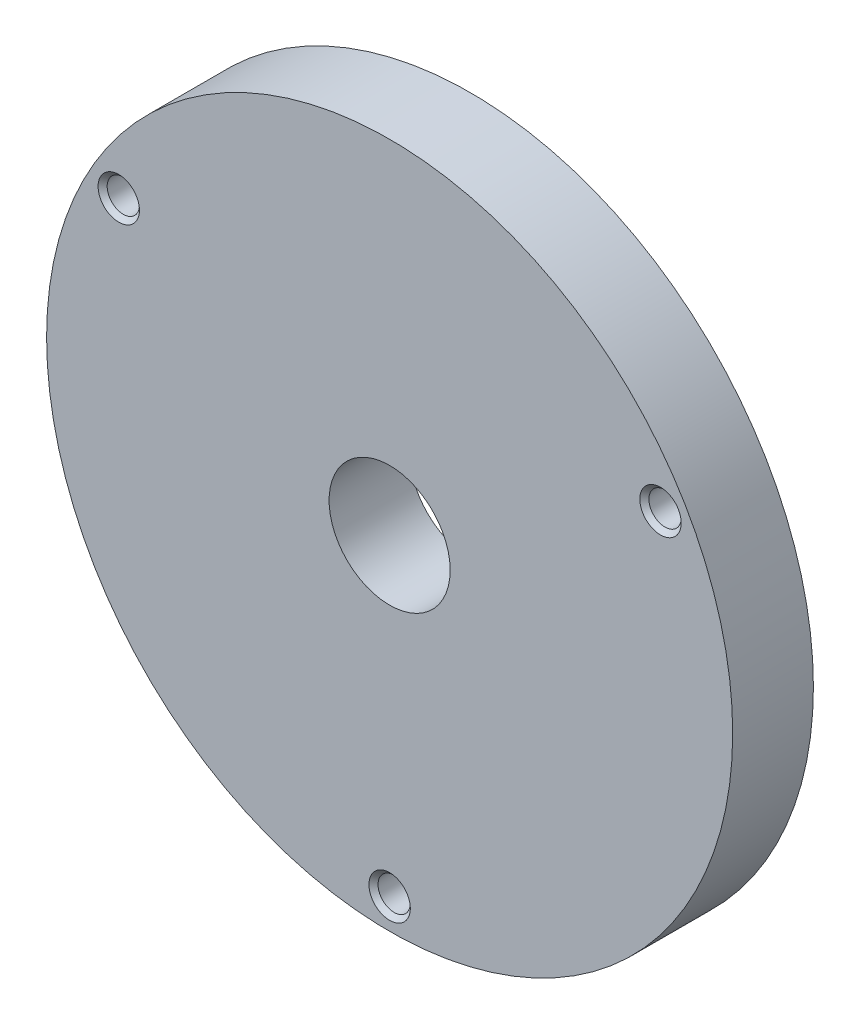
ISO-10303-21;
HEADER;
FILE_DESCRIPTION(('STEP AP214'),'2;1');
FILE_NAME('part.step','',(''),(''),'','','');
FILE_SCHEMA(('AUTOMOTIVE_DESIGN { 1 0 10303 214 1 1 1 1 }'));
ENDSEC;
DATA;
#1=APPLICATION_CONTEXT('core data for automotive mechanical design processes');
#2=APPLICATION_PROTOCOL_DEFINITION('international standard','automotive_design',2000,#1);
#3=PRODUCT_CONTEXT('',#1,'mechanical');
#4=PRODUCT('Part','Part','',(#3));
#5=PRODUCT_RELATED_PRODUCT_CATEGORY('part','',(#4));
#6=PRODUCT_DEFINITION_FORMATION('','',#4);
#7=PRODUCT_DEFINITION_CONTEXT('part definition',#1,'design');
#8=PRODUCT_DEFINITION('design','',#6,#7);
#9=PRODUCT_DEFINITION_SHAPE('','',#8);
#10=(LENGTH_UNIT() NAMED_UNIT(*) SI_UNIT(.MILLI.,.METRE.));
#11=(NAMED_UNIT(*) PLANE_ANGLE_UNIT() SI_UNIT($,.RADIAN.));
#12=(NAMED_UNIT(*) SI_UNIT($,.STERADIAN.) SOLID_ANGLE_UNIT());
#13=UNCERTAINTY_MEASURE_WITH_UNIT(LENGTH_MEASURE(1.E-05),#10,'distance_accuracy_value','');
#14=(GEOMETRIC_REPRESENTATION_CONTEXT(3) GLOBAL_UNCERTAINTY_ASSIGNED_CONTEXT((#13)) GLOBAL_UNIT_ASSIGNED_CONTEXT((#10,
#11,#12)) REPRESENTATION_CONTEXT('',''));
#15=CARTESIAN_POINT('',(0.,0.,0.));
#16=DIRECTION('',(0.,0.,1.));
#17=DIRECTION('',(1.,0.,0.));
#18=AXIS2_PLACEMENT_3D('',#15,#16,#17);
#19=CARTESIAN_POINT('',(0.,0.,-4.));
#20=DIRECTION('',(0.,0.,1.));
#21=DIRECTION('',(1.,0.,0.));
#22=AXIS2_PLACEMENT_3D('',#19,#20,#21);
#23=CYLINDRICAL_SURFACE('',#22,17.);
#24=CARTESIAN_POINT('',(0.,0.,-4.));
#25=DIRECTION('',(0.,0.,1.));
#26=DIRECTION('',(1.,0.,0.));
#27=AXIS2_PLACEMENT_3D('',#24,#25,#26);
#28=CIRCLE('',#27,17.);
#29=CARTESIAN_POINT('',(17.,0.,-4.));
#30=VERTEX_POINT('',#29);
#31=EDGE_CURVE('E10',#30,#30,#28,.T.);
#32=ORIENTED_EDGE('',*,*,#31,.T.);
#33=EDGE_LOOP('',(#32));
#34=FACE_BOUND('',#33,.T.);
#35=CARTESIAN_POINT('',(0.,0.,0.));
#36=DIRECTION('',(0.,0.,1.));
#37=DIRECTION('',(1.,0.,0.));
#38=AXIS2_PLACEMENT_3D('',#35,#36,#37);
#39=CIRCLE('',#38,17.);
#40=CARTESIAN_POINT('',(17.,0.,0.));
#41=VERTEX_POINT('',#40);
#42=EDGE_CURVE('E35',#41,#41,#39,.T.);
#43=ORIENTED_EDGE('',*,*,#42,.F.);
#44=EDGE_LOOP('',(#43));
#45=FACE_BOUND('',#44,.T.);
#46=ADVANCED_FACE('F32',(#34,#45),#23,.T.);
#47=CARTESIAN_POINT('',(0.,0.,-4.));
#48=DIRECTION('',(0.,0.,1.));
#49=DIRECTION('',(1.,0.,0.));
#50=AXIS2_PLACEMENT_3D('',#47,#48,#49);
#51=PLANE('',#50);
#52=CARTESIAN_POINT('',(0.,0.,-4.));
#53=DIRECTION('',(0.,0.,1.));
#54=DIRECTION('',(1.,0.,0.));
#55=AXIS2_PLACEMENT_3D('',#52,#53,#54);
#56=CIRCLE('',#55,3.);
#57=CARTESIAN_POINT('',(3.,0.,-4.));
#58=VERTEX_POINT('',#57);
#59=EDGE_CURVE('E70',#58,#58,#56,.T.);
#60=ORIENTED_EDGE('',*,*,#59,.T.);
#61=EDGE_LOOP('',(#60));
#62=FACE_BOUND('',#61,.T.);
#63=CARTESIAN_POINT('',(-13.4233937586589,7.74999999999987,-4.));
#64=DIRECTION('',(0.,0.,1.));
#65=DIRECTION('',(1.,0.,0.));
#66=AXIS2_PLACEMENT_3D('',#63,#64,#65);
#67=CIRCLE('',#66,0.799999999999986);
#68=CARTESIAN_POINT('',(-12.6233937586589,7.74999999999987,-4.));
#69=VERTEX_POINT('',#68);
#70=EDGE_CURVE('E61',#69,#69,#67,.T.);
#71=ORIENTED_EDGE('',*,*,#70,.T.);
#72=EDGE_LOOP('',(#71));
#73=FACE_BOUND('',#72,.T.);
#74=CARTESIAN_POINT('',(13.4233937586588,7.75000000000006,-4.));
#75=DIRECTION('',(0.,0.,1.));
#76=DIRECTION('',(1.,0.,0.));
#77=AXIS2_PLACEMENT_3D('',#74,#75,#76);
#78=CIRCLE('',#77,0.799999999999986);
#79=CARTESIAN_POINT('',(14.2233937586587,7.75000000000006,-4.));
#80=VERTEX_POINT('',#79);
#81=EDGE_CURVE('E52',#80,#80,#78,.T.);
#82=ORIENTED_EDGE('',*,*,#81,.T.);
#83=EDGE_LOOP('',(#82));
#84=FACE_BOUND('',#83,.T.);
#85=CARTESIAN_POINT('',(0.,-15.5,-4.));
#86=DIRECTION('',(0.,0.,1.));
#87=DIRECTION('',(1.,0.,0.));
#88=AXIS2_PLACEMENT_3D('',#85,#86,#87);
#89=CIRCLE('',#88,0.799999999999987);
#90=CARTESIAN_POINT('',(0.799999999999989,-15.5,-4.));
#91=VERTEX_POINT('',#90);
#92=EDGE_CURVE('E42',#91,#91,#89,.T.);
#93=ORIENTED_EDGE('',*,*,#92,.T.);
#94=EDGE_LOOP('',(#93));
#95=FACE_BOUND('',#94,.T.);
#96=ORIENTED_EDGE('',*,*,#31,.F.);
#97=EDGE_LOOP('',(#96));
#98=FACE_BOUND('',#97,.T.);
#99=ADVANCED_FACE('F77',(#62,#73,#84,#95,#98),#51,.F.);
#100=CARTESIAN_POINT('',(0.,0.,0.));
#101=DIRECTION('',(0.,0.,1.));
#102=DIRECTION('',(1.,0.,0.));
#103=AXIS2_PLACEMENT_3D('',#100,#101,#102);
#104=PLANE('',#103);
#105=CARTESIAN_POINT('',(0.,0.,0.));
#106=DIRECTION('',(0.,0.,1.));
#107=DIRECTION('',(1.,0.,0.));
#108=AXIS2_PLACEMENT_3D('',#105,#106,#107);
#109=CIRCLE('',#108,3.);
#110=CARTESIAN_POINT('',(3.,0.,0.));
#111=VERTEX_POINT('',#110);
#112=EDGE_CURVE('E71',#111,#111,#109,.T.);
#113=ORIENTED_EDGE('',*,*,#112,.F.);
#114=EDGE_LOOP('',(#113));
#115=FACE_BOUND('',#114,.T.);
#116=CARTESIAN_POINT('',(-13.4233937586589,7.74999999999987,0.));
#117=DIRECTION('',(0.,0.,1.));
#118=DIRECTION('',(1.,0.,0.));
#119=AXIS2_PLACEMENT_3D('',#116,#117,#118);
#120=CIRCLE('',#119,1.025);
#121=CARTESIAN_POINT('',(-12.3983937586589,7.74999999999987,0.));
#122=VERTEX_POINT('',#121);
#123=EDGE_CURVE('E67',#122,#122,#120,.T.);
#124=ORIENTED_EDGE('',*,*,#123,.F.);
#125=EDGE_LOOP('',(#124));
#126=FACE_BOUND('',#125,.T.);
#127=CARTESIAN_POINT('',(13.4233937586588,7.75000000000006,0.));
#128=DIRECTION('',(0.,0.,1.));
#129=DIRECTION('',(1.,0.,0.));
#130=AXIS2_PLACEMENT_3D('',#127,#128,#129);
#131=CIRCLE('',#130,1.025);
#132=CARTESIAN_POINT('',(14.4483937586588,7.75000000000006,0.));
#133=VERTEX_POINT('',#132);
#134=EDGE_CURVE('E58',#133,#133,#131,.T.);
#135=ORIENTED_EDGE('',*,*,#134,.F.);
#136=EDGE_LOOP('',(#135));
#137=FACE_BOUND('',#136,.T.);
#138=CARTESIAN_POINT('',(0.,-15.5,0.));
#139=DIRECTION('',(0.,0.,1.));
#140=DIRECTION('',(1.,0.,0.));
#141=AXIS2_PLACEMENT_3D('',#138,#139,#140);
#142=CIRCLE('',#141,1.025);
#143=CARTESIAN_POINT('',(1.025,-15.5,0.));
#144=VERTEX_POINT('',#143);
#145=EDGE_CURVE('E49',#144,#144,#142,.T.);
#146=ORIENTED_EDGE('',*,*,#145,.F.);
#147=EDGE_LOOP('',(#146));
#148=FACE_BOUND('',#147,.T.);
#149=ORIENTED_EDGE('',*,*,#42,.T.);
#150=EDGE_LOOP('',(#149));
#151=FACE_BOUND('',#150,.T.);
#152=ADVANCED_FACE('F87',(#115,#126,#137,#148,#151),#104,.T.);
#153=CARTESIAN_POINT('',(0.,-15.5,0.));
#154=DIRECTION('',(0.,0.,1.));
#155=DIRECTION('',(1.,0.,0.));
#156=AXIS2_PLACEMENT_3D('',#153,#154,#155);
#157=CYLINDRICAL_SURFACE('',#156,0.799999999999993);
#158=ORIENTED_EDGE('',*,*,#92,.F.);
#159=EDGE_LOOP('',(#158));
#160=FACE_BOUND('',#159,.T.);
#161=CARTESIAN_POINT('',(0.,-15.5,-0.225));
#162=DIRECTION('',(0.,0.,1.));
#163=DIRECTION('',(1.,0.,0.));
#164=AXIS2_PLACEMENT_3D('',#161,#162,#163);
#165=CIRCLE('',#164,0.799999999999999);
#166=CARTESIAN_POINT('',(0.800000000000001,-15.5,-0.225));
#167=VERTEX_POINT('',#166);
#168=EDGE_CURVE('E46',#167,#167,#165,.T.);
#169=ORIENTED_EDGE('',*,*,#168,.T.);
#170=EDGE_LOOP('',(#169));
#171=FACE_BOUND('',#170,.T.);
#172=ADVANCED_FACE('F90',(#160,#171),#157,.F.);
#173=CARTESIAN_POINT('',(0.,-15.5,0.));
#174=DIRECTION('',(0.,0.,1.));
#175=DIRECTION('',(1.,0.,0.));
#176=AXIS2_PLACEMENT_3D('',#173,#174,#175);
#177=CONICAL_SURFACE('',#176,1.025,0.785398163397445);
#178=ORIENTED_EDGE('',*,*,#168,.F.);
#179=EDGE_LOOP('',(#178));
#180=FACE_BOUND('',#179,.T.);
#181=ORIENTED_EDGE('',*,*,#145,.T.);
#182=EDGE_LOOP('',(#181));
#183=FACE_BOUND('',#182,.T.);
#184=ADVANCED_FACE('F109',(#180,#183),#177,.F.);
#185=CARTESIAN_POINT('',(13.4233937586588,7.75000000000006,0.));
#186=DIRECTION('',(0.,0.,1.));
#187=DIRECTION('',(1.,0.,0.));
#188=AXIS2_PLACEMENT_3D('',#185,#186,#187);
#189=CYLINDRICAL_SURFACE('',#188,0.799999999999993);
#190=ORIENTED_EDGE('',*,*,#81,.F.);
#191=EDGE_LOOP('',(#190));
#192=FACE_BOUND('',#191,.T.);
#193=CARTESIAN_POINT('',(13.4233937586588,7.75000000000006,-0.225));
#194=DIRECTION('',(0.,0.,1.));
#195=DIRECTION('',(1.,0.,0.));
#196=AXIS2_PLACEMENT_3D('',#193,#194,#195);
#197=CIRCLE('',#196,0.799999999999999);
#198=CARTESIAN_POINT('',(14.2233937586588,7.75000000000006,-0.225));
#199=VERTEX_POINT('',#198);
#200=EDGE_CURVE('E55',#199,#199,#197,.T.);
#201=ORIENTED_EDGE('',*,*,#200,.T.);
#202=EDGE_LOOP('',(#201));
#203=FACE_BOUND('',#202,.T.);
#204=ADVANCED_FACE('F113',(#192,#203),#189,.F.);
#205=CARTESIAN_POINT('',(13.4233937586588,7.75000000000006,0.));
#206=DIRECTION('',(0.,0.,1.));
#207=DIRECTION('',(1.,0.,0.));
#208=AXIS2_PLACEMENT_3D('',#205,#206,#207);
#209=CONICAL_SURFACE('',#208,1.025,0.785398163397446);
#210=ORIENTED_EDGE('',*,*,#200,.F.);
#211=EDGE_LOOP('',(#210));
#212=FACE_BOUND('',#211,.T.);
#213=ORIENTED_EDGE('',*,*,#134,.T.);
#214=EDGE_LOOP('',(#213));
#215=FACE_BOUND('',#214,.T.);
#216=ADVANCED_FACE('F117',(#212,#215),#209,.F.);
#217=CARTESIAN_POINT('',(-13.4233937586589,7.74999999999987,0.));
#218=DIRECTION('',(0.,0.,1.));
#219=DIRECTION('',(1.,0.,0.));
#220=AXIS2_PLACEMENT_3D('',#217,#218,#219);
#221=CYLINDRICAL_SURFACE('',#220,0.799999999999993);
#222=ORIENTED_EDGE('',*,*,#70,.F.);
#223=EDGE_LOOP('',(#222));
#224=FACE_BOUND('',#223,.T.);
#225=CARTESIAN_POINT('',(-13.4233937586589,7.74999999999987,-0.225));
#226=DIRECTION('',(0.,0.,1.));
#227=DIRECTION('',(1.,0.,0.));
#228=AXIS2_PLACEMENT_3D('',#225,#226,#227);
#229=CIRCLE('',#228,0.799999999999999);
#230=CARTESIAN_POINT('',(-12.6233937586589,7.74999999999987,-0.225));
#231=VERTEX_POINT('',#230);
#232=EDGE_CURVE('E64',#231,#231,#229,.T.);
#233=ORIENTED_EDGE('',*,*,#232,.T.);
#234=EDGE_LOOP('',(#233));
#235=FACE_BOUND('',#234,.T.);
#236=ADVANCED_FACE('F121',(#224,#235),#221,.F.);
#237=CARTESIAN_POINT('',(-13.4233937586589,7.74999999999987,0.));
#238=DIRECTION('',(0.,0.,1.));
#239=DIRECTION('',(1.,0.,0.));
#240=AXIS2_PLACEMENT_3D('',#237,#238,#239);
#241=CONICAL_SURFACE('',#240,1.025,0.785398163397446);
#242=ORIENTED_EDGE('',*,*,#232,.F.);
#243=EDGE_LOOP('',(#242));
#244=FACE_BOUND('',#243,.T.);
#245=ORIENTED_EDGE('',*,*,#123,.T.);
#246=EDGE_LOOP('',(#245));
#247=FACE_BOUND('',#246,.T.);
#248=ADVANCED_FACE('F83',(#244,#247),#241,.F.);
#249=CARTESIAN_POINT('',(0.,0.,-4.));
#250=DIRECTION('',(0.,0.,1.));
#251=DIRECTION('',(1.,0.,0.));
#252=AXIS2_PLACEMENT_3D('',#249,#250,#251);
#253=CYLINDRICAL_SURFACE('',#252,3.);
#254=ORIENTED_EDGE('',*,*,#59,.F.);
#255=EDGE_LOOP('',(#254));
#256=FACE_BOUND('',#255,.T.);
#257=ORIENTED_EDGE('',*,*,#112,.T.);
#258=EDGE_LOOP('',(#257));
#259=FACE_BOUND('',#258,.T.);
#260=ADVANCED_FACE('F80',(#256,#259),#253,.F.);
#261=CLOSED_SHELL('',(#46,#99,#152,#172,#184,#204,#216,#236,#248,#260));
#262=MANIFOLD_SOLID_BREP('B2',#261);
#263=ADVANCED_BREP_SHAPE_REPRESENTATION('',(#18,#262),#14);
#264=SHAPE_DEFINITION_REPRESENTATION(#9,#263);
ENDSEC;
END-ISO-10303-21;
